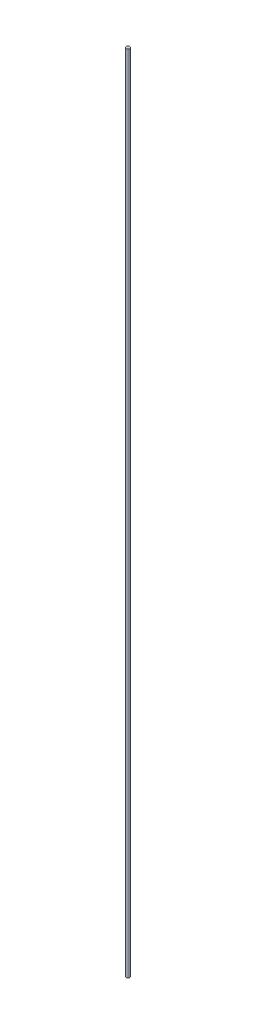
ISO-10303-21;
HEADER;
FILE_DESCRIPTION(('STEP AP214'),'2;1');
FILE_NAME('part.step','',(''),(''),'','','');
FILE_SCHEMA(('AUTOMOTIVE_DESIGN { 1 0 10303 214 1 1 1 1 }'));
ENDSEC;
DATA;
#1=APPLICATION_CONTEXT('core data for automotive mechanical design processes');
#2=APPLICATION_PROTOCOL_DEFINITION('international standard','automotive_design',2000,#1);
#3=PRODUCT_CONTEXT('',#1,'mechanical');
#4=PRODUCT('Part','Part','',(#3));
#5=PRODUCT_RELATED_PRODUCT_CATEGORY('part','',(#4));
#6=PRODUCT_DEFINITION_FORMATION('','',#4);
#7=PRODUCT_DEFINITION_CONTEXT('part definition',#1,'design');
#8=PRODUCT_DEFINITION('design','',#6,#7);
#9=PRODUCT_DEFINITION_SHAPE('','',#8);
#10=(LENGTH_UNIT() NAMED_UNIT(*) SI_UNIT(.MILLI.,.METRE.));
#11=(NAMED_UNIT(*) PLANE_ANGLE_UNIT() SI_UNIT($,.RADIAN.));
#12=(NAMED_UNIT(*) SI_UNIT($,.STERADIAN.) SOLID_ANGLE_UNIT());
#13=UNCERTAINTY_MEASURE_WITH_UNIT(LENGTH_MEASURE(1.E-05),#10,'distance_accuracy_value','');
#14=(GEOMETRIC_REPRESENTATION_CONTEXT(3) GLOBAL_UNCERTAINTY_ASSIGNED_CONTEXT((#13)) GLOBAL_UNIT_ASSIGNED_CONTEXT((#10,
#11,#12)) REPRESENTATION_CONTEXT('',''));
#15=CARTESIAN_POINT('',(0.,0.,0.));
#16=DIRECTION('',(0.,0.,1.));
#17=DIRECTION('',(1.,0.,0.));
#18=AXIS2_PLACEMENT_3D('',#15,#16,#17);
#19=CARTESIAN_POINT('',(0.,200.,0.));
#20=DIRECTION('',(0.,-1.,0.));
#21=DIRECTION('',(0.,0.,-1.));
#22=AXIS2_PLACEMENT_3D('',#19,#20,#21);
#23=CYLINDRICAL_SURFACE('',#22,0.45);
#24=CARTESIAN_POINT('',(0.,200.,0.));
#25=DIRECTION('',(0.,1.,0.));
#26=DIRECTION('',(0.,0.,1.));
#27=AXIS2_PLACEMENT_3D('',#24,#25,#26);
#28=CIRCLE('',#27,0.45);
#29=CARTESIAN_POINT('',(0.,200.,0.45));
#30=VERTEX_POINT('',#29);
#31=EDGE_CURVE('E10',#30,#30,#28,.T.);
#32=ORIENTED_EDGE('',*,*,#31,.F.);
#33=EDGE_LOOP('',(#32));
#34=FACE_BOUND('',#33,.T.);
#35=CARTESIAN_POINT('',(0.,0.,0.));
#36=DIRECTION('',(0.,1.,0.));
#37=DIRECTION('',(0.,0.,1.));
#38=AXIS2_PLACEMENT_3D('',#35,#36,#37);
#39=CIRCLE('',#38,0.45);
#40=CARTESIAN_POINT('',(0.,0.,0.45));
#41=VERTEX_POINT('',#40);
#42=EDGE_CURVE('E48',#41,#41,#39,.T.);
#43=ORIENTED_EDGE('',*,*,#42,.T.);
#44=EDGE_LOOP('',(#43));
#45=FACE_BOUND('',#44,.T.);
#46=ADVANCED_FACE('F45',(#34,#45),#23,.T.);
#47=CARTESIAN_POINT('',(0.,200.,0.));
#48=DIRECTION('',(0.,1.,0.));
#49=DIRECTION('',(0.,0.,1.));
#50=AXIS2_PLACEMENT_3D('',#47,#48,#49);
#51=PLANE('',#50);
#52=ORIENTED_EDGE('',*,*,#31,.T.);
#53=EDGE_LOOP('',(#52));
#54=FACE_BOUND('',#53,.T.);
#55=ADVANCED_FACE('F62',(#54),#51,.T.);
#56=CARTESIAN_POINT('',(0.,0.,0.));
#57=DIRECTION('',(0.,1.,0.));
#58=DIRECTION('',(0.,0.,1.));
#59=AXIS2_PLACEMENT_3D('',#56,#57,#58);
#60=PLANE('',#59);
#61=ORIENTED_EDGE('',*,*,#42,.F.);
#62=EDGE_LOOP('',(#61));
#63=FACE_BOUND('',#62,.T.);
#64=ADVANCED_FACE('F60',(#63),#60,.F.);
#65=CLOSED_SHELL('',(#46,#55,#64));
#66=MANIFOLD_SOLID_BREP('B2',#65);
#67=ADVANCED_BREP_SHAPE_REPRESENTATION('',(#18,#66),#14);
#68=SHAPE_DEFINITION_REPRESENTATION(#9,#67);
ENDSEC;
END-ISO-10303-21;
